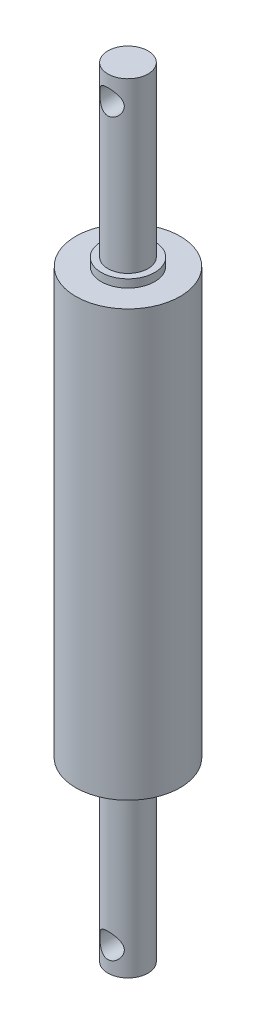
ISO-10303-21;
HEADER;
FILE_DESCRIPTION(('STEP AP214'),'2;1');
FILE_NAME('part.step','',(''),(''),'','','');
FILE_SCHEMA(('AUTOMOTIVE_DESIGN { 1 0 10303 214 1 1 1 1 }'));
ENDSEC;
DATA;
#1=APPLICATION_CONTEXT('core data for automotive mechanical design processes');
#2=APPLICATION_PROTOCOL_DEFINITION('international standard','automotive_design',2000,#1);
#3=PRODUCT_CONTEXT('',#1,'mechanical');
#4=PRODUCT('Part','Part','',(#3));
#5=PRODUCT_RELATED_PRODUCT_CATEGORY('part','',(#4));
#6=PRODUCT_DEFINITION_FORMATION('','',#4);
#7=PRODUCT_DEFINITION_CONTEXT('part definition',#1,'design');
#8=PRODUCT_DEFINITION('design','',#6,#7);
#9=PRODUCT_DEFINITION_SHAPE('','',#8);
#10=(LENGTH_UNIT() NAMED_UNIT(*) SI_UNIT(.MILLI.,.METRE.));
#11=(NAMED_UNIT(*) PLANE_ANGLE_UNIT() SI_UNIT($,.RADIAN.));
#12=(NAMED_UNIT(*) SI_UNIT($,.STERADIAN.) SOLID_ANGLE_UNIT());
#13=UNCERTAINTY_MEASURE_WITH_UNIT(LENGTH_MEASURE(1.E-05),#10,'distance_accuracy_value','');
#14=(GEOMETRIC_REPRESENTATION_CONTEXT(3) GLOBAL_UNCERTAINTY_ASSIGNED_CONTEXT((#13)) GLOBAL_UNIT_ASSIGNED_CONTEXT((#10,
#11,#12)) REPRESENTATION_CONTEXT('',''));
#15=CARTESIAN_POINT('',(0.,0.,0.));
#16=DIRECTION('',(0.,0.,1.));
#17=DIRECTION('',(1.,0.,0.));
#18=AXIS2_PLACEMENT_3D('',#15,#16,#17);
#19=CARTESIAN_POINT('',(0.,-97.,0.));
#20=DIRECTION('',(0.,1.,0.));
#21=DIRECTION('',(0.,0.,1.));
#22=AXIS2_PLACEMENT_3D('',#19,#20,#21);
#23=CYLINDRICAL_SURFACE('',#22,5.);
#24=CARTESIAN_POINT('',(3.05,-91.,-3.9620070671315));
#25=CARTESIAN_POINT('',(3.04999878498858,-90.9237023695772,-3.96200881544827));
#26=CARTESIAN_POINT('',(3.04712906289614,-90.8473772217506,-3.96422317733194));
#27=CARTESIAN_POINT('',(3.03571032954311,-90.6953865718236,-3.97297185121551));
#28=CARTESIAN_POINT('',(3.02715746144156,-90.6197215530706,-3.97950909690614));
#29=CARTESIAN_POINT('',(2.99311430341057,-90.3943489534951,-4.00526300697241));
#30=CARTESIAN_POINT('',(2.95924006990725,-90.246506318082,-4.03062054463044));
#31=CARTESIAN_POINT('',(2.87153628162519,-89.9612751824889,-4.09354393136702));
#32=CARTESIAN_POINT('',(2.81787262408966,-89.8238109048567,-4.13100797592621));
#33=CARTESIAN_POINT('',(2.69260671614841,-89.55996711664,-4.21372793605571));
#34=CARTESIAN_POINT('',(2.62100561437384,-89.433586896983,-4.2589833526445));
#35=CARTESIAN_POINT('',(2.45127744051945,-89.1778616509319,-4.35914154787425));
#36=CARTESIAN_POINT('',(2.35093606355432,-89.0501797420062,-4.41453953682835));
#37=CARTESIAN_POINT('',(2.13114136186131,-88.8120694170435,-4.52475473392867));
#38=CARTESIAN_POINT('',(2.01167203210144,-88.7016556041323,-4.57957141435476));
#39=CARTESIAN_POINT('',(1.74050500599038,-88.4888240957661,-4.68980764880231));
#40=CARTESIAN_POINT('',(1.58669155084369,-88.3887164242683,-4.74459659336227));
#41=CARTESIAN_POINT('',(1.34224623161856,-88.2596719648955,-4.81722511088912));
#42=CARTESIAN_POINT('',(1.25845011178201,-88.2201680932306,-4.83984741128208));
#43=CARTESIAN_POINT('',(1.08681565890207,-88.1486927246414,-4.88124967173811));
#44=CARTESIAN_POINT('',(0.998980092697196,-88.116716161066,-4.90003221522497));
#45=CARTESIAN_POINT('',(0.828705621708276,-88.0635203133874,-4.93153135424336));
#46=CARTESIAN_POINT('',(0.746574761817198,-88.0415564678485,-4.94466067075966));
#47=CARTESIAN_POINT('',(0.5802863603183,-88.0045003373606,-4.96692041236897));
#48=CARTESIAN_POINT('',(0.496129992552478,-87.9894041687588,-4.97605309743485));
#49=CARTESIAN_POINT('',(0.326536863499597,-87.9663242245569,-4.99005041728396));
#50=CARTESIAN_POINT('',(0.241100857014326,-87.9583364119903,-4.99491747457202));
#51=CARTESIAN_POINT('',(0.0697521801807254,-87.9495891969199,-5.00024987698112));
#52=CARTESIAN_POINT('',(-0.0161604382277364,-87.948829021671,-5.00071569266221));
#53=CARTESIAN_POINT('',(-0.251382372879567,-87.9567128125997,-4.99590325301659));
#54=CARTESIAN_POINT('',(-0.400437934105673,-87.9727521431624,-4.98610706724918));
#55=CARTESIAN_POINT('',(-0.693170928526881,-88.0260796652068,-4.9539140427353));
#56=CARTESIAN_POINT('',(-0.836847954820352,-88.063369460899,-4.93151625268764));
#57=CARTESIAN_POINT('',(-1.11605767511265,-88.1576894541283,-4.87593805737401));
#58=CARTESIAN_POINT('',(-1.25155014017355,-88.2148091042695,-4.84270883364749));
#59=CARTESIAN_POINT('',(-1.5111629278343,-88.3466785514951,-4.7680880387546));
#60=CARTESIAN_POINT('',(-1.63528043625768,-88.4214326951109,-4.72669445565845));
#61=CARTESIAN_POINT('',(-1.88480314794013,-88.5966683022455,-4.63328641260943));
#62=CARTESIAN_POINT('',(-2.0085320771191,-88.699172220236,-4.58059256929671));
#63=CARTESIAN_POINT('',(-2.23810218993327,-88.9217756558877,-4.47292042265831));
#64=CARTESIAN_POINT('',(-2.34391793516402,-89.0418997517481,-4.41793900643667));
#65=CARTESIAN_POINT('',(-2.54770755456168,-89.3135997865436,-4.30399729931127));
#66=CARTESIAN_POINT('',(-2.64315878174401,-89.4672243401127,-4.24536740143098));
#67=CARTESIAN_POINT('',(-2.80642727933415,-89.7919706226598,-4.13926208337192));
#68=CARTESIAN_POINT('',(-2.87429567174574,-89.9630592402611,-4.09176609742552));
#69=CARTESIAN_POINT('',(-2.96542875440823,-90.273470148097,-4.02598461473687));
#70=CARTESIAN_POINT('',(-2.99564366076475,-90.4098260008844,-4.00334416932346));
#71=CARTESIAN_POINT('',(-3.03710789523876,-90.686897301054,-3.97198708319797));
#72=CARTESIAN_POINT('',(-3.04838077439925,-90.8276071129352,-3.96325315291649));
#73=CARTESIAN_POINT('',(-3.05129597983532,-91.1095951036517,-3.96100980980647));
#74=CARTESIAN_POINT('',(-3.04290450330727,-91.2508738438232,-3.96752661278891));
#75=CARTESIAN_POINT('',(-3.00696095372993,-91.529592684062,-3.99483031902265));
#76=CARTESIAN_POINT('',(-2.97939339589276,-91.6670295884659,-4.01562875459392));
#77=CARTESIAN_POINT('',(-2.906814692081,-91.9337686295789,-4.06846395066956));
#78=CARTESIAN_POINT('',(-2.86192651870754,-92.0631208067861,-4.10042133631767));
#79=CARTESIAN_POINT('',(-2.75633290157654,-92.3128339709702,-4.17213335449815));
#80=CARTESIAN_POINT('',(-2.69562165006236,-92.4331916356553,-4.21189084868152));
#81=CARTESIAN_POINT('',(-2.54718682007539,-92.6850720149683,-4.30357557160423));
#82=CARTESIAN_POINT('',(-2.45654554206272,-92.8145536915794,-4.35639446116163));
#83=CARTESIAN_POINT('',(-2.25669017837016,-93.0578369321365,-4.4632092241866));
#84=CARTESIAN_POINT('',(-2.14745763437025,-93.1716227071542,-4.51720622043));
#85=CARTESIAN_POINT('',(-1.89495383173032,-93.3966798863859,-4.62933517742616));
#86=CARTESIAN_POINT('',(-1.74905253930789,-93.5053101299824,-4.68696880436127));
#87=CARTESIAN_POINT('',(-1.51558397872609,-93.6483701889756,-4.7654798729754));
#88=CARTESIAN_POINT('',(-1.43528796796612,-93.692757217155,-4.79033583061858));
#89=CARTESIAN_POINT('',(-1.27025899954673,-93.7744189849631,-4.83671021853601));
#90=CARTESIAN_POINT('',(-1.18552887728304,-93.8116982005432,-4.85823074759714));
#91=CARTESIAN_POINT('',(-1.01808383152615,-93.8763708961484,-4.89595432496014));
#92=CARTESIAN_POINT('',(-0.93561977460591,-93.9042622423031,-4.91241846520662));
#93=CARTESIAN_POINT('',(-0.768004538123648,-93.9530122266912,-4.94139623802576));
#94=CARTESIAN_POINT('',(-0.682854915122162,-93.9738748597436,-4.95391211436386));
#95=CARTESIAN_POINT('',(-0.510621067933832,-94.0082330546413,-4.97461321026096));
#96=CARTESIAN_POINT('',(-0.423538354807737,-94.0217341734862,-4.98280169630087));
#97=CARTESIAN_POINT('',(-0.248257845902203,-94.0411603382816,-4.99460727894729));
#98=CARTESIAN_POINT('',(-0.160060212178753,-94.0470864727703,-4.99822503237505));
#99=CARTESIAN_POINT('',(0.080275233821075,-94.0527185192123,-5.00165449028713));
#100=CARTESIAN_POINT('',(0.232748952753817,-94.0448785910966,-4.9968533465618));
#101=CARTESIAN_POINT('',(0.533701670043275,-94.006778491268,-4.97373106174367));
#102=CARTESIAN_POINT('',(0.682180702742787,-93.9765185123667,-4.95541003692142));
#103=CARTESIAN_POINT('',(0.967866524886752,-93.8960751114144,-4.90751828450656));
#104=CARTESIAN_POINT('',(1.10525452420213,-93.846368314212,-4.87821734105285));
#105=CARTESIAN_POINT('',(1.36970091252212,-93.7289877817653,-4.81067297719112));
#106=CARTESIAN_POINT('',(1.496757267996,-93.6613105206031,-4.77242780204452));
#107=CARTESIAN_POINT('',(1.75164133503919,-93.5018417074595,-4.68527237587196));
#108=CARTESIAN_POINT('',(1.87809546963659,-93.4082442372816,-4.63565869531436));
#109=CARTESIAN_POINT('',(2.11446744272349,-93.203636233509,-4.5327349192402));
#110=CARTESIAN_POINT('',(2.22436584927816,-93.0926055453019,-4.4794205856896));
#111=CARTESIAN_POINT('',(2.43969899225044,-92.8389258256768,-4.36629741938252));
#112=CARTESIAN_POINT('',(2.54255504450089,-92.6940332123857,-4.30657729549001));
#113=CARTESIAN_POINT('',(2.72258279770666,-92.3862790388515,-4.19508862790711));
#114=CARTESIAN_POINT('',(2.7997734584443,-92.2234308618708,-4.14331422976699));
#115=CARTESIAN_POINT('',(2.91111863471529,-91.9207194924499,-4.06558199222984));
#116=CARTESIAN_POINT('',(2.95103121842454,-91.7838267477864,-4.03644186893347));
#117=CARTESIAN_POINT('',(2.99635178482065,-91.5740198414369,-4.00277583170084));
#118=CARTESIAN_POINT('',(3.00902822552159,-91.5034159411098,-3.99323260668224));
#119=CARTESIAN_POINT('',(3.02939788210423,-91.3611129221979,-3.97780309391741));
#120=CARTESIAN_POINT('',(3.03709406352205,-91.2894144814517,-3.97191462999931));
#121=CARTESIAN_POINT('',(3.04482258767042,-91.1813031239816,-3.96598839231396));
#122=CARTESIAN_POINT('',(3.04676283824996,-91.1450913564369,-3.96449733454448));
#123=CARTESIAN_POINT('',(3.04935194825173,-91.072588477172,-3.96250616797485));
#124=CARTESIAN_POINT('',(3.05000057802185,-91.0362973524903,-3.96200623539833));
#125=CARTESIAN_POINT('',(3.05,-91.,-3.9620070671315));
#126=B_SPLINE_CURVE_WITH_KNOTS('',3,(#24,#25,#26,#27,#28,#29,#30,#31,#32,#33,#34,#35,#36,#37,
#38,#39,#40,#41,#42,#43,#44,#45,#46,#47,#48,#49,#50,#51,#52,#53,#54,#55,#56,#57,#58,#59,#60,#61,
#62,#63,#64,#65,#66,#67,#68,#69,#70,#71,#72,#73,#74,#75,#76,#77,#78,#79,#80,#81,#82,#83,#84,#85,
#86,#87,#88,#89,#90,#91,#92,#93,#94,#95,#96,#97,#98,#99,#100,#101,#102,#103,#104,#105,#106,#107,
#108,#109,#110,#111,#112,#113,#114,#115,#116,#117,#118,#119,#120,#121,#122,#123,#124,#125),
.UNSPECIFIED.,.T.,.F.,(4,2,2,2,2,2,2,2,2,2,2,2,2,2,2,2,2,2,2,2,2,2,2,2,2,2,2,2,2,2,2,2,2,2,2,2,
2,2,2,2,2,2,2,2,2,2,2,2,2,2,4),(0.,0.22884807575239,0.457851617037246,0.916575002562736,
1.37153717155401,1.82647021431103,2.33919944500351,2.85235995821283,3.42345446320998,
3.70917082563055,3.99469431816091,4.25239795851316,4.50995568644451,4.76736704907381,
5.02475089017872,5.47308828046033,5.9214595204898,6.37188022759446,6.82241207013268,
7.32769094780862,7.83368145682281,8.40126706225595,8.967795854297,9.39045580796381,
9.81258986922656,10.2354501063,10.6586522022633,11.078903356273,11.4993089784664,
11.9973298028833,12.4958480023972,13.065008843912,13.3498302717696,13.6344717443774,
13.8998745386677,14.165126233916,14.4301774199429,14.6951905133767,15.150926295777,
15.6066581589092,16.0518573519211,16.4971439604366,16.9901005658996,17.4836313346864,
18.0434001653383,18.6027545546911,19.0373974545234,19.2542645726176,19.4710024362938,
19.5798538213018,19.6887245585222),.UNSPECIFIED.);
#127=CARTESIAN_POINT('',(3.05,-91.,-3.9620070671315));
#128=VERTEX_POINT('',#127);
#129=EDGE_CURVE('E102',#128,#128,#126,.T.);
#130=ORIENTED_EDGE('',*,*,#129,.T.);
#131=EDGE_LOOP('',(#130));
#132=FACE_BOUND('',#131,.T.);
#133=CARTESIAN_POINT('',(0.,-97.,0.));
#134=DIRECTION('',(0.,1.,0.));
#135=DIRECTION('',(0.,0.,1.));
#136=AXIS2_PLACEMENT_3D('',#133,#134,#135);
#137=CIRCLE('',#136,5.);
#138=CARTESIAN_POINT('',(0.,-97.,5.));
#139=VERTEX_POINT('',#138);
#140=EDGE_CURVE('E228',#139,#139,#137,.T.);
#141=ORIENTED_EDGE('',*,*,#140,.T.);
#142=EDGE_LOOP('',(#141));
#143=FACE_BOUND('',#142,.T.);
#144=CARTESIAN_POINT('',(0.,-55.,0.));
#145=DIRECTION('',(0.,1.,0.));
#146=DIRECTION('',(0.,0.,1.));
#147=AXIS2_PLACEMENT_3D('',#144,#145,#146);
#148=CIRCLE('',#147,5.);
#149=CARTESIAN_POINT('',(0.,-55.,5.));
#150=VERTEX_POINT('',#149);
#151=EDGE_CURVE('E232',#150,#150,#148,.T.);
#152=ORIENTED_EDGE('',*,*,#151,.F.);
#153=EDGE_LOOP('',(#152));
#154=FACE_BOUND('',#153,.T.);
#155=CARTESIAN_POINT('',(0.,-94.05,5.));
#156=CARTESIAN_POINT('',(-0.0778388516711948,-94.0499989465697,4.99999907765824));
#157=CARTESIAN_POINT('',(-0.155694223240461,-94.0470135758674,4.99817611284761));
#158=CARTESIAN_POINT('',(-0.310794901911579,-94.0351232124901,4.99093735720534));
#159=CARTESIAN_POINT('',(-0.388039866908193,-94.0262151097363,4.98551967876099));
#160=CARTESIAN_POINT('',(-0.618203647339808,-93.9907149017011,4.9640191829666));
#161=CARTESIAN_POINT('',(-0.769394828397857,-93.9553471936724,4.94268926381667));
#162=CARTESIAN_POINT('',(-1.06184403182779,-93.8632921758268,4.88820916490483));
#163=CARTESIAN_POINT('',(-1.20314724922889,-93.8067105727134,4.85511763390327));
#164=CARTESIAN_POINT('',(-1.47382634240365,-93.6745130488506,4.77991284817376));
#165=CARTESIAN_POINT('',(-1.60320450438382,-93.5989007869683,4.73780132787601));
#166=CARTESIAN_POINT('',(-1.85771546961127,-93.4242624951777,4.64421002803892));
#167=CARTESIAN_POINT('',(-1.98173347876208,-93.3238718745558,4.59225613071579));
#168=CARTESIAN_POINT('',(-2.21226040779694,-93.1056219293309,4.48576212094617));
#169=CARTESIAN_POINT('',(-2.3187460559054,-92.9877397752749,4.43121869295272));
#170=CARTESIAN_POINT('',(-2.52499231178168,-92.720172606856,4.31740360897679));
#171=CARTESIAN_POINT('',(-2.62215822454235,-92.5683487349846,4.25841745509075));
#172=CARTESIAN_POINT('',(-2.78926152781661,-92.2470618306099,4.15089500845762));
#173=CARTESIAN_POINT('',(-2.85924390837239,-92.0776285368913,4.10234150920936));
#174=CARTESIAN_POINT('',(-2.95476494598713,-91.7688287970302,4.03384729342092));
#175=CARTESIAN_POINT('',(-2.9870272784075,-91.6324591207409,4.00979413403654));
#176=CARTESIAN_POINT('',(-3.03252587878816,-91.3549515981441,3.97550358778906));
#177=CARTESIAN_POINT('',(-3.0457870502911,-91.2138202415705,3.96524811830103));
#178=CARTESIAN_POINT('',(-3.05250587846757,-90.9304830813572,3.96007984866307));
#179=CARTESIAN_POINT('',(-3.04591978324774,-90.7882755942756,3.96520094497296));
#180=CARTESIAN_POINT('',(-3.01328022799258,-90.5073840982464,3.9900548764776));
#181=CARTESIAN_POINT('',(-2.98721171847245,-90.3687028989108,4.00979900734978));
#182=CARTESIAN_POINT('',(-2.91762708645337,-90.1006491369342,4.06069541948604));
#183=CARTESIAN_POINT('',(-2.87440874414839,-89.9711600180681,4.09165224815571));
#184=CARTESIAN_POINT('',(-2.77215505173566,-89.7209584169937,4.16160876340014));
#185=CARTESIAN_POINT('',(-2.71311399141532,-89.6002491233443,4.20061135241252));
#186=CARTESIAN_POINT('',(-2.56866691324739,-89.3479704275515,4.29073598282298));
#187=CARTESIAN_POINT('',(-2.48042947130344,-89.2183486870597,4.3427763406625));
#188=CARTESIAN_POINT('',(-2.28556878071316,-88.9743871037005,4.44842726153399));
#189=CARTESIAN_POINT('',(-2.17892737802416,-88.8600625498695,4.50203933117196));
#190=CARTESIAN_POINT('',(-1.93128100554039,-88.6325312370941,4.6142383852992));
#191=CARTESIAN_POINT('',(-1.78752282510818,-88.5220371943402,4.67237387414148));
#192=CARTESIAN_POINT('',(-1.5571128071804,-88.3758427058964,4.7520579536408));
#193=CARTESIAN_POINT('',(-1.47780710253189,-88.3303524042814,4.7773761234304));
#194=CARTESIAN_POINT('',(-1.31468398559504,-88.2463650528445,4.82481079138344));
#195=CARTESIAN_POINT('',(-1.23086939424432,-88.2078636949349,4.84692926017024));
#196=CARTESIAN_POINT('',(-1.06438345561979,-88.1404246872298,4.88609910691243));
#197=CARTESIAN_POINT('',(-0.981939343514438,-88.1110551309208,4.90337326625946));
#198=CARTESIAN_POINT('',(-0.814201359749358,-88.0593755386694,4.93399826167));
#199=CARTESIAN_POINT('',(-0.728909134244029,-88.0370615002644,4.94735132179177));
#200=CARTESIAN_POINT('',(-0.556224612257383,-87.9998494279831,4.96972643847576));
#201=CARTESIAN_POINT('',(-0.468834044124586,-87.9849454963603,4.97875193916293));
#202=CARTESIAN_POINT('',(-0.292772112984481,-87.9627858333581,4.99220368483327));
#203=CARTESIAN_POINT('',(-0.204100946894962,-87.9555289385227,4.99663062946088));
#204=CARTESIAN_POINT('',(0.0374310089007732,-87.946420418645,5.00217871951121));
#205=CARTESIAN_POINT('',(0.190780141649136,-87.9521626840358,4.99866132082673));
#206=CARTESIAN_POINT('',(0.493851525308588,-87.9863787887104,4.97787512612893));
#207=CARTESIAN_POINT('',(0.643573911518591,-88.014851778655,4.96060684392083));
#208=CARTESIAN_POINT('',(0.930945744841657,-88.0918547626065,4.91466057327219));
#209=CARTESIAN_POINT('',(1.06882245537089,-88.1397586474347,4.88633971606621));
#210=CARTESIAN_POINT('',(1.3345008356047,-88.2536347881033,4.82056695759532));
#211=CARTESIAN_POINT('',(1.46230064329512,-88.3196103732103,4.78311337398975));
#212=CARTESIAN_POINT('',(1.71845326195857,-88.4752939412284,4.69755002409706));
#213=CARTESIAN_POINT('',(1.8455089166198,-88.566745751781,4.64874021168674));
#214=CARTESIAN_POINT('',(2.0834086747827,-88.7670345105423,4.54710703840578));
#215=CARTESIAN_POINT('',(2.19423384550975,-88.8758914571002,4.49427909779811));
#216=CARTESIAN_POINT('',(2.41214495906876,-89.1251429840864,4.38161599049112));
#217=CARTESIAN_POINT('',(2.51665600033266,-89.2678141789102,4.32180854805984));
#218=CARTESIAN_POINT('',(2.70042681573953,-89.5711658899433,4.20943091963986));
#219=CARTESIAN_POINT('',(2.7797098526048,-89.731829629306,4.15685409186266));
#220=CARTESIAN_POINT('',(2.89584206509651,-90.0321889011916,4.0765160823178));
#221=CARTESIAN_POINT('',(2.93814563830721,-90.1689889857674,4.04585097274506));
#222=CARTESIAN_POINT('',(3.00331160590617,-90.4493142379208,3.99772321545273));
#223=CARTESIAN_POINT('',(3.02620246945419,-90.5928292306413,3.9802412385693));
#224=CARTESIAN_POINT('',(3.05127030052332,-90.8834103329573,3.96106375303602));
#225=CARTESIAN_POINT('',(3.05335419490429,-91.0304894511584,3.95943917798751));
#226=CARTESIAN_POINT('',(3.03641076550812,-91.3227282470304,3.97244349330974));
#227=CARTESIAN_POINT('',(3.01737334551543,-91.4678869731569,3.98708015673207));
#228=CARTESIAN_POINT('',(2.9611837248449,-91.7432807550798,4.02895786251572));
#229=CARTESIAN_POINT('',(2.92519758559457,-91.873887319322,4.05538245950605));
#230=CARTESIAN_POINT('',(2.83722175422177,-92.1272432030816,4.11740919177777));
#231=CARTESIAN_POINT('',(2.78522589203122,-92.2499894712098,4.15301486453893));
#232=CARTESIAN_POINT('',(2.65771452109543,-92.5040622102072,4.23593673826083));
#233=CARTESIAN_POINT('',(2.57983282312908,-92.633884532258,4.28420941832915));
#234=CARTESIAN_POINT('',(2.40647702351712,-92.8799046115463,4.38393421994309));
#235=CARTESIAN_POINT('',(2.3109883487845,-92.9960909511114,4.43538895161487));
#236=CARTESIAN_POINT('',(2.08533996751827,-93.2327397435544,4.54641020542336));
#237=CARTESIAN_POINT('',(1.9520348242364,-93.350309044323,4.60579774019503));
#238=CARTESIAN_POINT('',(1.66474963264471,-93.5618055834672,4.71723128043499));
#239=CARTESIAN_POINT('',(1.51076025435596,-93.655722097565,4.76927395102508));
#240=CARTESIAN_POINT('',(1.26847855757469,-93.7751406397982,4.83713544925026));
#241=CARTESIAN_POINT('',(1.18660863756918,-93.8111436598123,4.85791511023443));
#242=CARTESIAN_POINT('',(1.01928734613848,-93.876036918128,4.8957520428367));
#243=CARTESIAN_POINT('',(0.933838095569175,-93.904931300642,4.912811482617));
#244=CARTESIAN_POINT('',(0.760277502647662,-93.9551004726418,4.94264245788147));
#245=CARTESIAN_POINT('',(0.672174501946424,-93.9763968867101,4.95542615595836));
#246=CARTESIAN_POINT('',(0.493936394662659,-94.0111055469704,4.97635039188386));
#247=CARTESIAN_POINT('',(0.403802964269806,-94.0245240656199,4.98449462356725));
#248=CARTESIAN_POINT('',(0.261183903496895,-94.0392456065376,4.99344550381308));
#249=CARTESIAN_POINT('',(0.209064530953023,-94.0432754923679,4.99590044749683));
#250=CARTESIAN_POINT('',(0.104632599925127,-94.0486531111284,4.9991780469491));
#251=CARTESIAN_POINT('',(0.0523200317811663,-94.050000708072,5.00000061995969));
#252=CARTESIAN_POINT('',(0.,-94.05,5.));
#253=B_SPLINE_CURVE_WITH_KNOTS('',3,(#155,#156,#157,#158,#159,#160,#161,#162,#163,#164,#165,
#166,#167,#168,#169,#170,#171,#172,#173,#174,#175,#176,#177,#178,#179,#180,#181,#182,#183,#184,
#185,#186,#187,#188,#189,#190,#191,#192,#193,#194,#195,#196,#197,#198,#199,#200,#201,#202,#203,
#204,#205,#206,#207,#208,#209,#210,#211,#212,#213,#214,#215,#216,#217,#218,#219,#220,#221,#222,
#223,#224,#225,#226,#227,#228,#229,#230,#231,#232,#233,#234,#235,#236,#237,#238,#239,#240,#241,
#242,#243,#244,#245,#246,#247,#248,#249,#250,#251,#252),.UNSPECIFIED.,.T.,.F.,(4,2,2,2,2,2,2,2,
2,2,2,2,2,2,2,2,2,2,2,2,2,2,2,2,2,2,2,2,2,2,2,2,2,2,2,2,2,2,2,2,2,2,2,2,2,2,2,2,4),(0.,
0.233458535021085,0.46703975809677,0.934665170810635,1.39999076995565,1.86522697305303,
2.36668526169528,2.86880389210039,3.43503441191022,4.00032375906919,4.42508135522064,
4.84928173935707,5.27441792673387,5.69988285684871,6.11826261906274,6.53679357287519,
7.03055085150834,7.52479799575645,8.09280088938955,8.37706631818939,8.66115592212051,
8.92838944484465,9.19547109789613,9.46233983747257,9.72916796852223,10.1871029137378,
10.6450207489017,11.0892268578409,11.5335148559414,12.0235349878701,12.5141222490531,
13.071668533087,13.6286992042348,14.0662357684013,14.5031295606067,14.9419767827821,
15.3810338690676,15.7935186376559,16.2061625752357,16.6811305447033,17.156493418763,
17.7161246849021,18.2760092353615,18.5511187684318,18.8260675353322,19.1002274076632,
19.3741686941332,19.5310818358762,19.688002932599),.UNSPECIFIED.);
#254=CARTESIAN_POINT('',(0.,-94.05,5.));
#255=VERTEX_POINT('',#254);
#256=EDGE_CURVE('E40',#255,#255,#253,.T.);
#257=ORIENTED_EDGE('',*,*,#256,.T.);
#258=EDGE_LOOP('',(#257));
#259=FACE_BOUND('',#258,.T.);
#260=ADVANCED_FACE('F36',(#132,#143,#154,#259),#23,.T.);
#261=CARTESIAN_POINT('',(0.,-53.,0.));
#262=DIRECTION('',(0.,1.,0.));
#263=DIRECTION('',(0.,0.,1.));
#264=AXIS2_PLACEMENT_3D('',#261,#262,#263);
#265=CYLINDRICAL_SURFACE('',#264,13.);
#266=CARTESIAN_POINT('',(0.,-53.,0.));
#267=DIRECTION('',(0.,1.,0.));
#268=DIRECTION('',(0.,0.,1.));
#269=AXIS2_PLACEMENT_3D('',#266,#267,#268);
#270=CIRCLE('',#269,13.);
#271=CARTESIAN_POINT('',(0.,-53.,13.));
#272=VERTEX_POINT('',#271);
#273=EDGE_CURVE('E54',#272,#272,#270,.T.);
#274=ORIENTED_EDGE('',*,*,#273,.T.);
#275=EDGE_LOOP('',(#274));
#276=FACE_BOUND('',#275,.T.);
#277=CARTESIAN_POINT('',(0.,53.,0.));
#278=DIRECTION('',(0.,1.,0.));
#279=DIRECTION('',(0.,0.,1.));
#280=AXIS2_PLACEMENT_3D('',#277,#278,#279);
#281=CIRCLE('',#280,13.);
#282=CARTESIAN_POINT('',(0.,53.,13.));
#283=VERTEX_POINT('',#282);
#284=EDGE_CURVE('E62',#283,#283,#281,.T.);
#285=ORIENTED_EDGE('',*,*,#284,.F.);
#286=EDGE_LOOP('',(#285));
#287=FACE_BOUND('',#286,.T.);
#288=ADVANCED_FACE('F38',(#276,#287),#265,.T.);
#289=CARTESIAN_POINT('',(0.,-53.,0.));
#290=DIRECTION('',(0.,1.,0.));
#291=DIRECTION('',(0.,0.,1.));
#292=AXIS2_PLACEMENT_3D('',#289,#290,#291);
#293=PLANE('',#292);
#294=CARTESIAN_POINT('',(0.,-53.,0.));
#295=DIRECTION('',(0.,1.,0.));
#296=DIRECTION('',(0.,0.,1.));
#297=AXIS2_PLACEMENT_3D('',#294,#295,#296);
#298=CIRCLE('',#297,6.65);
#299=CARTESIAN_POINT('',(0.,-53.,6.65));
#300=VERTEX_POINT('',#299);
#301=EDGE_CURVE('E225',#300,#300,#298,.T.);
#302=ORIENTED_EDGE('',*,*,#301,.T.);
#303=EDGE_LOOP('',(#302));
#304=FACE_BOUND('',#303,.T.);
#305=ORIENTED_EDGE('',*,*,#273,.F.);
#306=EDGE_LOOP('',(#305));
#307=FACE_BOUND('',#306,.T.);
#308=ADVANCED_FACE('F174',(#304,#307),#293,.F.);
#309=CARTESIAN_POINT('',(0.,53.,0.));
#310=DIRECTION('',(0.,1.,0.));
#311=DIRECTION('',(0.,0.,1.));
#312=AXIS2_PLACEMENT_3D('',#309,#310,#311);
#313=PLANE('',#312);
#314=CARTESIAN_POINT('',(0.,53.,0.));
#315=DIRECTION('',(0.,1.,0.));
#316=DIRECTION('',(0.,0.,1.));
#317=AXIS2_PLACEMENT_3D('',#314,#315,#316);
#318=CIRCLE('',#317,6.65);
#319=CARTESIAN_POINT('',(0.,53.,6.65));
#320=VERTEX_POINT('',#319);
#321=EDGE_CURVE('E49',#320,#320,#318,.T.);
#322=ORIENTED_EDGE('',*,*,#321,.F.);
#323=EDGE_LOOP('',(#322));
#324=FACE_BOUND('',#323,.T.);
#325=ORIENTED_EDGE('',*,*,#284,.T.);
#326=EDGE_LOOP('',(#325));
#327=FACE_BOUND('',#326,.T.);
#328=ADVANCED_FACE('F166',(#324,#327),#313,.T.);
#329=CARTESIAN_POINT('',(0.,55.,0.));
#330=DIRECTION('',(0.,-1.,0.));
#331=DIRECTION('',(0.,0.,-1.));
#332=AXIS2_PLACEMENT_3D('',#329,#330,#331);
#333=CYLINDRICAL_SURFACE('',#332,6.65);
#334=CARTESIAN_POINT('',(0.,55.,0.));
#335=DIRECTION('',(0.,1.,0.));
#336=DIRECTION('',(0.,0.,1.));
#337=AXIS2_PLACEMENT_3D('',#334,#335,#336);
#338=CIRCLE('',#337,6.65);
#339=CARTESIAN_POINT('',(0.,55.,6.65));
#340=VERTEX_POINT('',#339);
#341=EDGE_CURVE('E60',#340,#340,#338,.T.);
#342=ORIENTED_EDGE('',*,*,#341,.F.);
#343=EDGE_LOOP('',(#342));
#344=FACE_BOUND('',#343,.T.);
#345=ORIENTED_EDGE('',*,*,#321,.T.);
#346=EDGE_LOOP('',(#345));
#347=FACE_BOUND('',#346,.T.);
#348=ADVANCED_FACE('F159',(#344,#347),#333,.T.);
#349=CARTESIAN_POINT('',(0.,55.,0.));
#350=DIRECTION('',(0.,1.,0.));
#351=DIRECTION('',(0.,0.,1.));
#352=AXIS2_PLACEMENT_3D('',#349,#350,#351);
#353=PLANE('',#352);
#354=CARTESIAN_POINT('',(0.,55.,0.));
#355=DIRECTION('',(0.,1.,0.));
#356=DIRECTION('',(0.,0.,1.));
#357=AXIS2_PLACEMENT_3D('',#354,#355,#356);
#358=CIRCLE('',#357,5.);
#359=CARTESIAN_POINT('',(0.,55.,5.));
#360=VERTEX_POINT('',#359);
#361=EDGE_CURVE('E10',#360,#360,#358,.T.);
#362=ORIENTED_EDGE('',*,*,#361,.F.);
#363=EDGE_LOOP('',(#362));
#364=FACE_BOUND('',#363,.T.);
#365=ORIENTED_EDGE('',*,*,#341,.T.);
#366=EDGE_LOOP('',(#365));
#367=FACE_BOUND('',#366,.T.);
#368=ADVANCED_FACE('F153',(#364,#367),#353,.T.);
#369=CARTESIAN_POINT('',(0.,97.,0.));
#370=DIRECTION('',(0.,-1.,0.));
#371=DIRECTION('',(0.,0.,-1.));
#372=AXIS2_PLACEMENT_3D('',#369,#370,#371);
#373=CYLINDRICAL_SURFACE('',#372,5.);
#374=CARTESIAN_POINT('',(0.,94.05,-5.));
#375=CARTESIAN_POINT('',(-0.0778388516711948,94.0499989465697,-4.99999907765824));
#376=CARTESIAN_POINT('',(-0.155694223240461,94.0470135758674,-4.99817611284761));
#377=CARTESIAN_POINT('',(-0.310794901911579,94.0351232124901,-4.99093735720534));
#378=CARTESIAN_POINT('',(-0.388039866908193,94.0262151097363,-4.98551967876099));
#379=CARTESIAN_POINT('',(-0.618203647339808,93.9907149017011,-4.9640191829666));
#380=CARTESIAN_POINT('',(-0.769394828397857,93.9553471936724,-4.94268926381667));
#381=CARTESIAN_POINT('',(-1.06184403182779,93.8632921758268,-4.88820916490483));
#382=CARTESIAN_POINT('',(-1.20314724922889,93.8067105727134,-4.85511763390327));
#383=CARTESIAN_POINT('',(-1.47382634240365,93.6745130488506,-4.77991284817376));
#384=CARTESIAN_POINT('',(-1.60320450438382,93.5989007869683,-4.73780132787601));
#385=CARTESIAN_POINT('',(-1.85771546961127,93.4242624951777,-4.64421002803892));
#386=CARTESIAN_POINT('',(-1.98173347876208,93.3238718745558,-4.59225613071579));
#387=CARTESIAN_POINT('',(-2.21226040779694,93.1056219293309,-4.48576212094617));
#388=CARTESIAN_POINT('',(-2.3187460559054,92.9877397752749,-4.43121869295272));
#389=CARTESIAN_POINT('',(-2.52499231178168,92.720172606856,-4.31740360897679));
#390=CARTESIAN_POINT('',(-2.62215822454235,92.5683487349846,-4.25841745509075));
#391=CARTESIAN_POINT('',(-2.78926152781661,92.2470618306099,-4.15089500845762));
#392=CARTESIAN_POINT('',(-2.85924390837239,92.0776285368913,-4.10234150920936));
#393=CARTESIAN_POINT('',(-2.95476494598713,91.7688287970302,-4.03384729342092));
#394=CARTESIAN_POINT('',(-2.9870272784075,91.6324591207409,-4.00979413403654));
#395=CARTESIAN_POINT('',(-3.03252587878816,91.3549515981441,-3.97550358778906));
#396=CARTESIAN_POINT('',(-3.0457870502911,91.2138202415705,-3.96524811830103));
#397=CARTESIAN_POINT('',(-3.05250587846757,90.9304830813572,-3.96007984866307));
#398=CARTESIAN_POINT('',(-3.04591978324774,90.7882755942756,-3.96520094497296));
#399=CARTESIAN_POINT('',(-3.01328022799258,90.5073840982464,-3.9900548764776));
#400=CARTESIAN_POINT('',(-2.98721171847245,90.3687028989108,-4.00979900734978));
#401=CARTESIAN_POINT('',(-2.91762708645337,90.1006491369342,-4.06069541948604));
#402=CARTESIAN_POINT('',(-2.87440874414839,89.9711600180681,-4.09165224815571));
#403=CARTESIAN_POINT('',(-2.77215505173566,89.7209584169937,-4.16160876340014));
#404=CARTESIAN_POINT('',(-2.71311399141532,89.6002491233443,-4.20061135241252));
#405=CARTESIAN_POINT('',(-2.56866691324739,89.3479704275515,-4.29073598282298));
#406=CARTESIAN_POINT('',(-2.48042947130344,89.2183486870597,-4.3427763406625));
#407=CARTESIAN_POINT('',(-2.28556878071316,88.9743871037005,-4.44842726153399));
#408=CARTESIAN_POINT('',(-2.17892737802416,88.8600625498695,-4.50203933117196));
#409=CARTESIAN_POINT('',(-1.93128100554039,88.6325312370941,-4.6142383852992));
#410=CARTESIAN_POINT('',(-1.78752282510818,88.5220371943402,-4.67237387414148));
#411=CARTESIAN_POINT('',(-1.5571128071804,88.3758427058964,-4.7520579536408));
#412=CARTESIAN_POINT('',(-1.47780710253189,88.3303524042814,-4.7773761234304));
#413=CARTESIAN_POINT('',(-1.31468398559504,88.2463650528445,-4.82481079138344));
#414=CARTESIAN_POINT('',(-1.23086939424432,88.2078636949349,-4.84692926017024));
#415=CARTESIAN_POINT('',(-1.06438345561979,88.1404246872298,-4.88609910691243));
#416=CARTESIAN_POINT('',(-0.981939343514438,88.1110551309208,-4.90337326625946));
#417=CARTESIAN_POINT('',(-0.814201359749358,88.0593755386694,-4.93399826167));
#418=CARTESIAN_POINT('',(-0.728909134244029,88.0370615002644,-4.94735132179177));
#419=CARTESIAN_POINT('',(-0.556224612257383,87.9998494279831,-4.96972643847576));
#420=CARTESIAN_POINT('',(-0.468834044124586,87.9849454963603,-4.97875193916293));
#421=CARTESIAN_POINT('',(-0.292772112984481,87.9627858333581,-4.99220368483327));
#422=CARTESIAN_POINT('',(-0.204100946894962,87.9555289385227,-4.99663062946088));
#423=CARTESIAN_POINT('',(0.0374310089007732,87.946420418645,-5.00217871951121));
#424=CARTESIAN_POINT('',(0.190780141649136,87.9521626840358,-4.99866132082673));
#425=CARTESIAN_POINT('',(0.493851525308588,87.9863787887104,-4.97787512612893));
#426=CARTESIAN_POINT('',(0.643573911518591,88.014851778655,-4.96060684392083));
#427=CARTESIAN_POINT('',(0.930945744841657,88.0918547626065,-4.91466057327219));
#428=CARTESIAN_POINT('',(1.06882245537089,88.1397586474347,-4.88633971606621));
#429=CARTESIAN_POINT('',(1.3345008356047,88.2536347881033,-4.82056695759532));
#430=CARTESIAN_POINT('',(1.46230064329512,88.3196103732103,-4.78311337398975));
#431=CARTESIAN_POINT('',(1.71845326195857,88.4752939412284,-4.69755002409706));
#432=CARTESIAN_POINT('',(1.8455089166198,88.566745751781,-4.64874021168674));
#433=CARTESIAN_POINT('',(2.0834086747827,88.7670345105423,-4.54710703840578));
#434=CARTESIAN_POINT('',(2.19423384550975,88.8758914571002,-4.49427909779811));
#435=CARTESIAN_POINT('',(2.41214495906876,89.1251429840864,-4.38161599049112));
#436=CARTESIAN_POINT('',(2.51665600033266,89.2678141789102,-4.32180854805984));
#437=CARTESIAN_POINT('',(2.70042681573953,89.5711658899433,-4.20943091963986));
#438=CARTESIAN_POINT('',(2.7797098526048,89.731829629306,-4.15685409186266));
#439=CARTESIAN_POINT('',(2.89584206509651,90.0321889011916,-4.0765160823178));
#440=CARTESIAN_POINT('',(2.93814563830721,90.1689889857674,-4.04585097274506));
#441=CARTESIAN_POINT('',(3.00331160590617,90.4493142379208,-3.99772321545273));
#442=CARTESIAN_POINT('',(3.02620246945419,90.5928292306413,-3.9802412385693));
#443=CARTESIAN_POINT('',(3.05127030052332,90.8834103329573,-3.96106375303602));
#444=CARTESIAN_POINT('',(3.05335419490429,91.0304894511584,-3.95943917798751));
#445=CARTESIAN_POINT('',(3.03641076550812,91.3227282470304,-3.97244349330974));
#446=CARTESIAN_POINT('',(3.01737334551543,91.4678869731569,-3.98708015673207));
#447=CARTESIAN_POINT('',(2.9611837248449,91.7432807550798,-4.02895786251572));
#448=CARTESIAN_POINT('',(2.92519758559457,91.873887319322,-4.05538245950605));
#449=CARTESIAN_POINT('',(2.83722175422177,92.1272432030816,-4.11740919177777));
#450=CARTESIAN_POINT('',(2.78522589203122,92.2499894712098,-4.15301486453893));
#451=CARTESIAN_POINT('',(2.65771452109543,92.5040622102072,-4.23593673826083));
#452=CARTESIAN_POINT('',(2.57983282312908,92.633884532258,-4.28420941832915));
#453=CARTESIAN_POINT('',(2.40647702351712,92.8799046115463,-4.38393421994309));
#454=CARTESIAN_POINT('',(2.3109883487845,92.9960909511114,-4.43538895161487));
#455=CARTESIAN_POINT('',(2.08533996751827,93.2327397435544,-4.54641020542336));
#456=CARTESIAN_POINT('',(1.9520348242364,93.350309044323,-4.60579774019503));
#457=CARTESIAN_POINT('',(1.66474963264471,93.5618055834672,-4.71723128043499));
#458=CARTESIAN_POINT('',(1.51076025435596,93.655722097565,-4.76927395102508));
#459=CARTESIAN_POINT('',(1.26847855757469,93.7751406397982,-4.83713544925026));
#460=CARTESIAN_POINT('',(1.18660863756918,93.8111436598123,-4.85791511023443));
#461=CARTESIAN_POINT('',(1.01928734613848,93.876036918128,-4.8957520428367));
#462=CARTESIAN_POINT('',(0.933838095569175,93.904931300642,-4.912811482617));
#463=CARTESIAN_POINT('',(0.760277502647662,93.9551004726418,-4.94264245788147));
#464=CARTESIAN_POINT('',(0.672174501946424,93.9763968867101,-4.95542615595836));
#465=CARTESIAN_POINT('',(0.493936394662659,94.0111055469704,-4.97635039188386));
#466=CARTESIAN_POINT('',(0.403802964269806,94.0245240656199,-4.98449462356725));
#467=CARTESIAN_POINT('',(0.261183903496895,94.0392456065376,-4.99344550381308));
#468=CARTESIAN_POINT('',(0.209064530953023,94.0432754923679,-4.99590044749683));
#469=CARTESIAN_POINT('',(0.104632599925127,94.0486531111284,-4.9991780469491));
#470=CARTESIAN_POINT('',(0.0523200317811663,94.050000708072,-5.00000061995969));
#471=CARTESIAN_POINT('',(0.,94.05,-5.));
#472=B_SPLINE_CURVE_WITH_KNOTS('',3,(#374,#375,#376,#377,#378,#379,#380,#381,#382,#383,#384,
#385,#386,#387,#388,#389,#390,#391,#392,#393,#394,#395,#396,#397,#398,#399,#400,#401,#402,#403,
#404,#405,#406,#407,#408,#409,#410,#411,#412,#413,#414,#415,#416,#417,#418,#419,#420,#421,#422,
#423,#424,#425,#426,#427,#428,#429,#430,#431,#432,#433,#434,#435,#436,#437,#438,#439,#440,#441,
#442,#443,#444,#445,#446,#447,#448,#449,#450,#451,#452,#453,#454,#455,#456,#457,#458,#459,#460,
#461,#462,#463,#464,#465,#466,#467,#468,#469,#470,#471),.UNSPECIFIED.,.T.,.F.,(4,2,2,2,2,2,2,2,
2,2,2,2,2,2,2,2,2,2,2,2,2,2,2,2,2,2,2,2,2,2,2,2,2,2,2,2,2,2,2,2,2,2,2,2,2,2,2,2,4),(0.,
0.233458535021085,0.46703975809677,0.934665170810635,1.39999076995565,1.86522697305303,
2.36668526169528,2.86880389210039,3.43503441191022,4.00032375906919,4.42508135522064,
4.84928173935707,5.27441792673387,5.69988285684871,6.11826261906274,6.53679357287519,
7.03055085150834,7.52479799575645,8.09280088938955,8.37706631818939,8.66115592212051,
8.92838944484465,9.19547109789613,9.46233983747257,9.72916796852223,10.1871029137378,
10.6450207489017,11.0892268578409,11.5335148559414,12.0235349878701,12.5141222490531,
13.071668533087,13.6286992042348,14.0662357684013,14.5031295606067,14.9419767827821,
15.3810338690676,15.7935186376559,16.2061625752357,16.6811305447033,17.156493418763,
17.7161246849021,18.2760092353615,18.5511187684318,18.8260675353322,19.1002274076632,
19.3741686941332,19.5310818358762,19.688002932599),.UNSPECIFIED.);
#473=CARTESIAN_POINT('',(0.,94.05,-5.));
#474=VERTEX_POINT('',#473);
#475=EDGE_CURVE('E76',#474,#474,#472,.T.);
#476=ORIENTED_EDGE('',*,*,#475,.T.);
#477=EDGE_LOOP('',(#476));
#478=FACE_BOUND('',#477,.T.);
#479=CARTESIAN_POINT('',(3.05,91.,3.96200706713151));
#480=CARTESIAN_POINT('',(3.04999878498858,90.9237023695771,3.96200881544828));
#481=CARTESIAN_POINT('',(3.04712906289614,90.8473772217506,3.96422317733195));
#482=CARTESIAN_POINT('',(3.03571032954311,90.6953865718235,3.97297185121551));
#483=CARTESIAN_POINT('',(3.02715746144155,90.6197215530706,3.97950909690614));
#484=CARTESIAN_POINT('',(2.99311430341057,90.3943489534951,4.00526300697241));
#485=CARTESIAN_POINT('',(2.95924006990725,90.246506318082,4.03062054463044));
#486=CARTESIAN_POINT('',(2.87153628162519,89.9612751824889,4.09354393136702));
#487=CARTESIAN_POINT('',(2.81787262408966,89.8238109048567,4.13100797592621));
#488=CARTESIAN_POINT('',(2.69260671614841,89.55996711664,4.21372793605571));
#489=CARTESIAN_POINT('',(2.62100561437384,89.433586896983,4.2589833526445));
#490=CARTESIAN_POINT('',(2.45127744051945,89.1778616509319,4.35914154787425));
#491=CARTESIAN_POINT('',(2.35093606355432,89.0501797420062,4.41453953682835));
#492=CARTESIAN_POINT('',(2.13114136186131,88.8120694170435,4.52475473392867));
#493=CARTESIAN_POINT('',(2.01167203210144,88.7016556041323,4.57957141435476));
#494=CARTESIAN_POINT('',(1.74050500599038,88.4888240957661,4.68980764880231));
#495=CARTESIAN_POINT('',(1.58669155084369,88.3887164242683,4.74459659336227));
#496=CARTESIAN_POINT('',(1.34224623161856,88.2596719648955,4.81722511088912));
#497=CARTESIAN_POINT('',(1.25845011178201,88.2201680932306,4.83984741128208));
#498=CARTESIAN_POINT('',(1.08681565890206,88.1486927246414,4.88124967173811));
#499=CARTESIAN_POINT('',(0.998980092697196,88.116716161066,4.90003221522497));
#500=CARTESIAN_POINT('',(0.828705621708275,88.0635203133874,4.93153135424336));
#501=CARTESIAN_POINT('',(0.746574761817197,88.0415564678485,4.94466067075966));
#502=CARTESIAN_POINT('',(0.5802863603183,88.0045003373606,4.96692041236897));
#503=CARTESIAN_POINT('',(0.496129992552477,87.9894041687588,4.97605309743485));
#504=CARTESIAN_POINT('',(0.326536863499597,87.9663242245569,4.99005041728396));
#505=CARTESIAN_POINT('',(0.241100857014326,87.9583364119903,4.99491747457202));
#506=CARTESIAN_POINT('',(0.0697521801807251,87.9495891969199,5.00024987698112));
#507=CARTESIAN_POINT('',(-0.0161604382277368,87.948829021671,5.00071569266221));
#508=CARTESIAN_POINT('',(-0.251382372879568,87.9567128125997,4.99590325301659));
#509=CARTESIAN_POINT('',(-0.400437934105674,87.9727521431624,4.98610706724918));
#510=CARTESIAN_POINT('',(-0.693170928526882,88.0260796652068,4.9539140427353));
#511=CARTESIAN_POINT('',(-0.836847954820352,88.063369460899,4.93151625268764));
#512=CARTESIAN_POINT('',(-1.11605767511265,88.1576894541283,4.87593805737401));
#513=CARTESIAN_POINT('',(-1.25155014017355,88.2148091042695,4.84270883364749));
#514=CARTESIAN_POINT('',(-1.5111629278343,88.3466785514951,4.7680880387546));
#515=CARTESIAN_POINT('',(-1.63528043625768,88.4214326951109,4.72669445565845));
#516=CARTESIAN_POINT('',(-1.88480314794013,88.5966683022455,4.63328641260943));
#517=CARTESIAN_POINT('',(-2.0085320771191,88.699172220236,4.58059256929671));
#518=CARTESIAN_POINT('',(-2.23810218993327,88.9217756558877,4.47292042265831));
#519=CARTESIAN_POINT('',(-2.34391793516402,89.0418997517481,4.41793900643667));
#520=CARTESIAN_POINT('',(-2.54770755456168,89.3135997865436,4.30399729931127));
#521=CARTESIAN_POINT('',(-2.64315878174401,89.4672243401127,4.24536740143098));
#522=CARTESIAN_POINT('',(-2.80642727933415,89.7919706226598,4.13926208337192));
#523=CARTESIAN_POINT('',(-2.87429567174574,89.9630592402611,4.09176609742552));
#524=CARTESIAN_POINT('',(-2.96542875440823,90.273470148097,4.02598461473687));
#525=CARTESIAN_POINT('',(-2.99564366076475,90.4098260008844,4.00334416932346));
#526=CARTESIAN_POINT('',(-3.03710789523876,90.686897301054,3.97198708319797));
#527=CARTESIAN_POINT('',(-3.04838077439925,90.8276071129352,3.96325315291649));
#528=CARTESIAN_POINT('',(-3.05129597983532,91.1095951036517,3.96100980980647));
#529=CARTESIAN_POINT('',(-3.04290450330727,91.2508738438232,3.96752661278891));
#530=CARTESIAN_POINT('',(-3.00696095372993,91.529592684062,3.99483031902265));
#531=CARTESIAN_POINT('',(-2.97939339589276,91.6670295884659,4.01562875459392));
#532=CARTESIAN_POINT('',(-2.906814692081,91.9337686295789,4.06846395066956));
#533=CARTESIAN_POINT('',(-2.86192651870754,92.0631208067861,4.10042133631767));
#534=CARTESIAN_POINT('',(-2.75633290157654,92.3128339709702,4.17213335449815));
#535=CARTESIAN_POINT('',(-2.69562165006236,92.4331916356553,4.21189084868152));
#536=CARTESIAN_POINT('',(-2.54718682007539,92.6850720149683,4.30357557160423));
#537=CARTESIAN_POINT('',(-2.45654554206272,92.8145536915794,4.35639446116163));
#538=CARTESIAN_POINT('',(-2.25669017837016,93.0578369321365,4.4632092241866));
#539=CARTESIAN_POINT('',(-2.14745763437025,93.1716227071542,4.51720622043));
#540=CARTESIAN_POINT('',(-1.89495383173032,93.3966798863859,4.62933517742616));
#541=CARTESIAN_POINT('',(-1.74905253930789,93.5053101299824,4.68696880436127));
#542=CARTESIAN_POINT('',(-1.51558397872609,93.6483701889756,4.7654798729754));
#543=CARTESIAN_POINT('',(-1.43528796796612,93.692757217155,4.79033583061858));
#544=CARTESIAN_POINT('',(-1.27025899954673,93.7744189849631,4.83671021853601));
#545=CARTESIAN_POINT('',(-1.18552887728304,93.8116982005432,4.85823074759714));
#546=CARTESIAN_POINT('',(-1.01808383152615,93.8763708961484,4.89595432496014));
#547=CARTESIAN_POINT('',(-0.93561977460591,93.9042622423031,4.91241846520662));
#548=CARTESIAN_POINT('',(-0.768004538123648,93.9530122266912,4.94139623802576));
#549=CARTESIAN_POINT('',(-0.682854915122162,93.9738748597436,4.95391211436386));
#550=CARTESIAN_POINT('',(-0.510621067933832,94.0082330546413,4.97461321026096));
#551=CARTESIAN_POINT('',(-0.423538354807737,94.0217341734862,4.98280169630087));
#552=CARTESIAN_POINT('',(-0.248257845902203,94.0411603382816,4.99460727894729));
#553=CARTESIAN_POINT('',(-0.160060212178753,94.0470864727703,4.99822503237505));
#554=CARTESIAN_POINT('',(0.080275233821075,94.0527185192123,5.00165449028713));
#555=CARTESIAN_POINT('',(0.232748952753817,94.0448785910966,4.9968533465618));
#556=CARTESIAN_POINT('',(0.533701670043275,94.006778491268,4.97373106174367));
#557=CARTESIAN_POINT('',(0.682180702742787,93.9765185123667,4.95541003692142));
#558=CARTESIAN_POINT('',(0.967866524886753,93.8960751114144,4.90751828450656));
#559=CARTESIAN_POINT('',(1.10525452420213,93.846368314212,4.87821734105285));
#560=CARTESIAN_POINT('',(1.36970091252212,93.7289877817653,4.81067297719112));
#561=CARTESIAN_POINT('',(1.496757267996,93.6613105206031,4.77242780204452));
#562=CARTESIAN_POINT('',(1.75164133503918,93.5018417074595,4.68527237587196));
#563=CARTESIAN_POINT('',(1.87809546963659,93.4082442372816,4.63565869531437));
#564=CARTESIAN_POINT('',(2.11446744272349,93.203636233509,4.5327349192402));
#565=CARTESIAN_POINT('',(2.22436584927816,93.0926055453019,4.4794205856896));
#566=CARTESIAN_POINT('',(2.43969899225044,92.8389258256768,4.36629741938252));
#567=CARTESIAN_POINT('',(2.54255504450089,92.6940332123857,4.30657729549001));
#568=CARTESIAN_POINT('',(2.72258279770666,92.3862790388515,4.19508862790711));
#569=CARTESIAN_POINT('',(2.7997734584443,92.2234308618708,4.14331422976699));
#570=CARTESIAN_POINT('',(2.91111863471529,91.9207194924499,4.06558199222984));
#571=CARTESIAN_POINT('',(2.95103121842454,91.7838267477864,4.03644186893347));
#572=CARTESIAN_POINT('',(2.99635178482065,91.5740198414369,4.00277583170084));
#573=CARTESIAN_POINT('',(3.00902822552159,91.5034159411098,3.99323260668224));
#574=CARTESIAN_POINT('',(3.02939788210423,91.3611129221979,3.97780309391741));
#575=CARTESIAN_POINT('',(3.03709406352205,91.2894144814517,3.97191462999931));
#576=CARTESIAN_POINT('',(3.04482258767042,91.1813031239816,3.96598839231396));
#577=CARTESIAN_POINT('',(3.04676283824996,91.1450913564369,3.96449733454448));
#578=CARTESIAN_POINT('',(3.04935194825173,91.072588477172,3.96250616797486));
#579=CARTESIAN_POINT('',(3.05000057802185,91.0362973524903,3.96200623539834));
#580=CARTESIAN_POINT('',(3.05,91.,3.96200706713151));
#581=B_SPLINE_CURVE_WITH_KNOTS('',3,(#479,#480,#481,#482,#483,#484,#485,#486,#487,#488,#489,
#490,#491,#492,#493,#494,#495,#496,#497,#498,#499,#500,#501,#502,#503,#504,#505,#506,#507,#508,
#509,#510,#511,#512,#513,#514,#515,#516,#517,#518,#519,#520,#521,#522,#523,#524,#525,#526,#527,
#528,#529,#530,#531,#532,#533,#534,#535,#536,#537,#538,#539,#540,#541,#542,#543,#544,#545,#546,
#547,#548,#549,#550,#551,#552,#553,#554,#555,#556,#557,#558,#559,#560,#561,#562,#563,#564,#565,
#566,#567,#568,#569,#570,#571,#572,#573,#574,#575,#576,#577,#578,#579,#580),.UNSPECIFIED.,.T.,
.F.,(4,2,2,2,2,2,2,2,2,2,2,2,2,2,2,2,2,2,2,2,2,2,2,2,2,2,2,2,2,2,2,2,2,2,2,2,2,2,2,2,2,2,2,2,2,
2,2,2,2,2,4),(0.,0.228848075752404,0.45785161703726,0.916575002562736,1.37153717155401,
1.82647021431103,2.33919944500351,2.85235995821283,3.42345446320998,3.70917082563055,
3.99469431816091,4.25239795851316,4.50995568644451,4.76736704907381,5.02475089017872,
5.47308828046033,5.9214595204898,6.37188022759446,6.82241207013268,7.32769094780861,
7.83368145682281,8.40126706225595,8.967795854297,9.39045580796381,9.81258986922656,
10.2354501063,10.6586522022633,11.078903356273,11.4993089784664,11.9973298028833,
12.4958480023972,13.065008843912,13.3498302717696,13.6344717443774,13.8998745386677,
14.165126233916,14.4301774199429,14.6951905133767,15.150926295777,15.6066581589092,
16.0518573519211,16.4971439604366,16.9901005658996,17.4836313346864,18.0434001653383,
18.6027545546911,19.0373974545234,19.2542645726176,19.4710024362938,19.5798538213018,
19.6887245585222),.UNSPECIFIED.);
#582=CARTESIAN_POINT('',(3.05,91.,3.96200706713151));
#583=VERTEX_POINT('',#582);
#584=EDGE_CURVE('E68',#583,#583,#581,.T.);
#585=ORIENTED_EDGE('',*,*,#584,.T.);
#586=EDGE_LOOP('',(#585));
#587=FACE_BOUND('',#586,.T.);
#588=CARTESIAN_POINT('',(0.,97.,0.));
#589=DIRECTION('',(0.,1.,0.));
#590=DIRECTION('',(0.,0.,1.));
#591=AXIS2_PLACEMENT_3D('',#588,#589,#590);
#592=CIRCLE('',#591,5.);
#593=CARTESIAN_POINT('',(0.,97.,5.));
#594=VERTEX_POINT('',#593);
#595=EDGE_CURVE('E58',#594,#594,#592,.T.);
#596=ORIENTED_EDGE('',*,*,#595,.F.);
#597=EDGE_LOOP('',(#596));
#598=FACE_BOUND('',#597,.T.);
#599=ORIENTED_EDGE('',*,*,#361,.T.);
#600=EDGE_LOOP('',(#599));
#601=FACE_BOUND('',#600,.T.);
#602=ADVANCED_FACE('F80',(#478,#587,#598,#601),#373,.T.);
#603=CARTESIAN_POINT('',(0.,97.,0.));
#604=DIRECTION('',(0.,1.,0.));
#605=DIRECTION('',(0.,0.,1.));
#606=AXIS2_PLACEMENT_3D('',#603,#604,#605);
#607=PLANE('',#606);
#608=ORIENTED_EDGE('',*,*,#595,.T.);
#609=EDGE_LOOP('',(#608));
#610=FACE_BOUND('',#609,.T.);
#611=ADVANCED_FACE('F139',(#610),#607,.T.);
#612=CARTESIAN_POINT('',(0.,-55.,0.));
#613=DIRECTION('',(0.,1.,0.));
#614=DIRECTION('',(0.,0.,1.));
#615=AXIS2_PLACEMENT_3D('',#612,#613,#614);
#616=CYLINDRICAL_SURFACE('',#615,6.65);
#617=CARTESIAN_POINT('',(0.,-55.,0.));
#618=DIRECTION('',(0.,1.,0.));
#619=DIRECTION('',(0.,0.,1.));
#620=AXIS2_PLACEMENT_3D('',#617,#618,#619);
#621=CIRCLE('',#620,6.65);
#622=CARTESIAN_POINT('',(0.,-55.,6.65));
#623=VERTEX_POINT('',#622);
#624=EDGE_CURVE('E227',#623,#623,#621,.T.);
#625=ORIENTED_EDGE('',*,*,#624,.T.);
#626=EDGE_LOOP('',(#625));
#627=FACE_BOUND('',#626,.T.);
#628=ORIENTED_EDGE('',*,*,#301,.F.);
#629=EDGE_LOOP('',(#628));
#630=FACE_BOUND('',#629,.T.);
#631=ADVANCED_FACE('F132',(#627,#630),#616,.T.);
#632=CARTESIAN_POINT('',(0.,-55.,0.));
#633=DIRECTION('',(0.,-1.,0.));
#634=DIRECTION('',(0.,0.,1.));
#635=AXIS2_PLACEMENT_3D('',#632,#633,#634);
#636=PLANE('',#635);
#637=ORIENTED_EDGE('',*,*,#151,.T.);
#638=EDGE_LOOP('',(#637));
#639=FACE_BOUND('',#638,.T.);
#640=ORIENTED_EDGE('',*,*,#624,.F.);
#641=EDGE_LOOP('',(#640));
#642=FACE_BOUND('',#641,.T.);
#643=ADVANCED_FACE('F94',(#639,#642),#636,.T.);
#644=CARTESIAN_POINT('',(0.,-97.,0.));
#645=DIRECTION('',(0.,-1.,0.));
#646=DIRECTION('',(0.,0.,1.));
#647=AXIS2_PLACEMENT_3D('',#644,#645,#646);
#648=PLANE('',#647);
#649=ORIENTED_EDGE('',*,*,#140,.F.);
#650=EDGE_LOOP('',(#649));
#651=FACE_BOUND('',#650,.T.);
#652=ADVANCED_FACE('F89',(#651),#648,.T.);
#653=CARTESIAN_POINT('',(0.,91.,-13.));
#654=DIRECTION('',(0.,0.,1.));
#655=DIRECTION('',(1.,0.,0.));
#656=AXIS2_PLACEMENT_3D('',#653,#654,#655);
#657=CYLINDRICAL_SURFACE('',#656,3.05);
#658=ORIENTED_EDGE('',*,*,#584,.F.);
#659=EDGE_LOOP('',(#658));
#660=FACE_BOUND('',#659,.T.);
#661=ORIENTED_EDGE('',*,*,#475,.F.);
#662=EDGE_LOOP('',(#661));
#663=FACE_BOUND('',#662,.T.);
#664=ADVANCED_FACE('F84',(#660,#663),#657,.F.);
#665=CARTESIAN_POINT('',(0.,-91.,-13.));
#666=DIRECTION('',(0.,0.,1.));
#667=DIRECTION('',(1.,0.,0.));
#668=AXIS2_PLACEMENT_3D('',#665,#666,#667);
#669=CYLINDRICAL_SURFACE('',#668,3.05);
#670=ORIENTED_EDGE('',*,*,#256,.F.);
#671=EDGE_LOOP('',(#670));
#672=FACE_BOUND('',#671,.T.);
#673=ORIENTED_EDGE('',*,*,#129,.F.);
#674=EDGE_LOOP('',(#673));
#675=FACE_BOUND('',#674,.T.);
#676=ADVANCED_FACE('F88',(#672,#675),#669,.F.);
#677=CLOSED_SHELL('',(#260,#288,#308,#328,#348,#368,#602,#611,#631,#643,#652,#664,#676));
#678=MANIFOLD_SOLID_BREP('B2',#677);
#679=ADVANCED_BREP_SHAPE_REPRESENTATION('',(#18,#678),#14);
#680=SHAPE_DEFINITION_REPRESENTATION(#9,#679);
ENDSEC;
END-ISO-10303-21;
